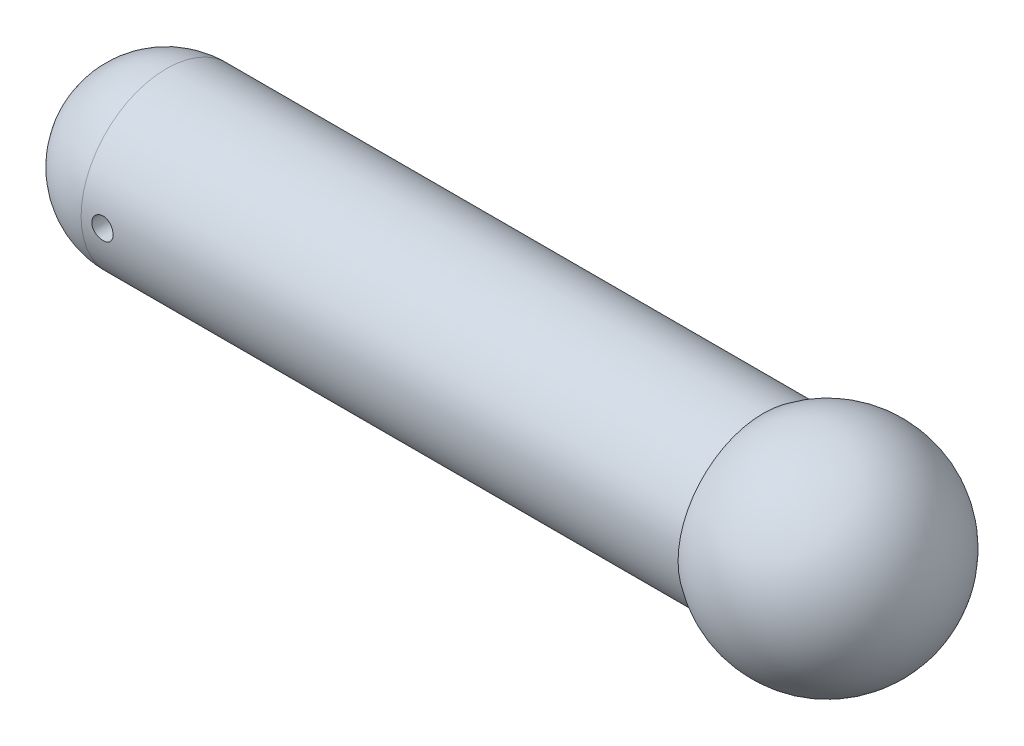
ISO-10303-21;
HEADER;
FILE_DESCRIPTION(('STEP AP214'),'2;1');
FILE_NAME('part.step','',(''),(''),'','','');
FILE_SCHEMA(('AUTOMOTIVE_DESIGN { 1 0 10303 214 1 1 1 1 }'));
ENDSEC;
DATA;
#1=APPLICATION_CONTEXT('core data for automotive mechanical design processes');
#2=APPLICATION_PROTOCOL_DEFINITION('international standard','automotive_design',2000,#1);
#3=PRODUCT_CONTEXT('',#1,'mechanical');
#4=PRODUCT('Part','Part','',(#3));
#5=PRODUCT_RELATED_PRODUCT_CATEGORY('part','',(#4));
#6=PRODUCT_DEFINITION_FORMATION('','',#4);
#7=PRODUCT_DEFINITION_CONTEXT('part definition',#1,'design');
#8=PRODUCT_DEFINITION('design','',#6,#7);
#9=PRODUCT_DEFINITION_SHAPE('','',#8);
#10=(LENGTH_UNIT() NAMED_UNIT(*) SI_UNIT(.MILLI.,.METRE.));
#11=(NAMED_UNIT(*) PLANE_ANGLE_UNIT() SI_UNIT($,.RADIAN.));
#12=(NAMED_UNIT(*) SI_UNIT($,.STERADIAN.) SOLID_ANGLE_UNIT());
#13=UNCERTAINTY_MEASURE_WITH_UNIT(LENGTH_MEASURE(1.E-05),#10,'distance_accuracy_value','');
#14=(GEOMETRIC_REPRESENTATION_CONTEXT(3) GLOBAL_UNCERTAINTY_ASSIGNED_CONTEXT((#13)) GLOBAL_UNIT_ASSIGNED_CONTEXT((#10,
#11,#12)) REPRESENTATION_CONTEXT('',''));
#15=CARTESIAN_POINT('',(0.,0.,0.));
#16=DIRECTION('',(0.,0.,1.));
#17=DIRECTION('',(1.,0.,0.));
#18=AXIS2_PLACEMENT_3D('',#15,#16,#17);
#19=CARTESIAN_POINT('',(-32.9192546583851,0.,0.));
#20=DIRECTION('',(-1.,0.,0.));
#21=DIRECTION('',(0.,0.,-1.));
#22=AXIS2_PLACEMENT_3D('',#19,#20,#21);
#23=SPHERICAL_SURFACE('',#22,20.);
#24=CARTESIAN_POINT('',(-32.9192546583851,0.,0.));
#25=DIRECTION('',(-1.,0.,0.));
#26=DIRECTION('',(0.,0.,1.));
#27=AXIS2_PLACEMENT_3D('',#24,#25,#26);
#28=CIRCLE('',#27,20.);
#29=CARTESIAN_POINT('',(-32.9192546583851,0.,20.));
#30=VERTEX_POINT('',#29);
#31=EDGE_CURVE('E42',#30,#30,#28,.T.);
#32=ORIENTED_EDGE('',*,*,#31,.T.);
#33=EDGE_LOOP('',(#32));
#34=FACE_BOUND('',#33,.T.);
#35=ADVANCED_FACE('F30',(#34),#23,.T.);
#36=CARTESIAN_POINT('',(122.080745341615,0.,0.));
#37=DIRECTION('',(-1.,0.,0.));
#38=DIRECTION('',(0.,0.,-1.));
#39=AXIS2_PLACEMENT_3D('',#36,#37,#38);
#40=SPHERICAL_SURFACE('',#39,25.);
#41=CARTESIAN_POINT('',(107.080745341615,0.,0.));
#42=DIRECTION('',(-1.,0.,0.));
#43=DIRECTION('',(0.,0.,1.));
#44=AXIS2_PLACEMENT_3D('',#41,#42,#43);
#45=CIRCLE('',#44,20.);
#46=CARTESIAN_POINT('',(107.080745341615,0.,20.));
#47=VERTEX_POINT('',#46);
#48=EDGE_CURVE('E10',#47,#47,#45,.T.);
#49=ORIENTED_EDGE('',*,*,#48,.F.);
#50=EDGE_LOOP('',(#49));
#51=FACE_BOUND('',#50,.T.);
#52=ADVANCED_FACE('F63',(#51),#40,.T.);
#53=CARTESIAN_POINT('',(-63.0852809193508,0.,0.));
#54=DIRECTION('',(-1.,0.,0.));
#55=DIRECTION('',(0.,0.,1.));
#56=AXIS2_PLACEMENT_3D('',#53,#54,#55);
#57=CYLINDRICAL_SURFACE('',#56,20.);
#58=CARTESIAN_POINT('',(-25.4192546583851,0.,20.));
#59=CARTESIAN_POINT('',(-25.4192605993208,-0.139841095555762,19.9999980489643));
#60=CARTESIAN_POINT('',(-25.4310275375544,-0.279769574302747,19.998517845549));
#61=CARTESIAN_POINT('',(-25.4777824129559,-0.555732802089753,19.9927554011136));
#62=CARTESIAN_POINT('',(-25.5127945963085,-0.691763330623745,19.9884702344143));
#63=CARTESIAN_POINT('',(-25.6049923022992,-0.955895574813053,19.9775806104441));
#64=CARTESIAN_POINT('',(-25.6621629001949,-1.08400256014614,19.9709777145554));
#65=CARTESIAN_POINT('',(-25.7970219423549,-1.32877947489303,19.956187008781));
#66=CARTESIAN_POINT('',(-25.8747068669158,-1.44545136155637,19.9479994708412));
#67=CARTESIAN_POINT('',(-26.0488466082247,-1.66471281693132,19.9309032130633));
#68=CARTESIAN_POINT('',(-26.1453917877313,-1.76723036493713,19.9219911469242));
#69=CARTESIAN_POINT('',(-26.3543174819217,-1.95465279355749,19.9044772600975));
#70=CARTESIAN_POINT('',(-26.4666988032983,-2.03955677639225,19.8958754552427));
#71=CARTESIAN_POINT('',(-26.7045746359508,-2.18961016128394,19.8799230561959));
#72=CARTESIAN_POINT('',(-26.830112019953,-2.25469209594107,19.8725767717791));
#73=CARTESIAN_POINT('',(-27.0904417103324,-2.36282307657512,19.8600112845768));
#74=CARTESIAN_POINT('',(-27.2252336655321,-2.40587295806521,19.8547920011314));
#75=CARTESIAN_POINT('',(-27.4994988539719,-2.46849898002476,19.8471033960361));
#76=CARTESIAN_POINT('',(-27.6389439160893,-2.4881967147317,19.8446198343675));
#77=CARTESIAN_POINT('',(-27.9191809218569,-2.50393554955723,19.8426402814279));
#78=CARTESIAN_POINT('',(-28.0599728111164,-2.49997760100242,19.8431441700151));
#79=CARTESIAN_POINT('',(-28.3380594856339,-2.4686172364479,19.8470695536975));
#80=CARTESIAN_POINT('',(-28.4753696445853,-2.4413487629847,19.8504743796033));
#81=CARTESIAN_POINT('',(-28.7434496796041,-2.36435038318205,19.8597919975763));
#82=CARTESIAN_POINT('',(-28.8742194230991,-2.3146200217519,19.8657048404572));
#83=CARTESIAN_POINT('',(-29.1259226574068,-2.19396555991165,19.8793911586465));
#84=CARTESIAN_POINT('',(-29.2468279586341,-2.12298325370764,19.8871697321144));
#85=CARTESIAN_POINT('',(-29.4750613527983,-1.96188146945692,19.903707114306));
#86=CARTESIAN_POINT('',(-29.5823888243588,-1.87176111608078,19.9124659678566));
#87=CARTESIAN_POINT('',(-29.7811973691078,-1.67419911075378,19.9300510989043));
#88=CARTESIAN_POINT('',(-29.8725637501511,-1.56664200784001,19.9388774238689));
#89=CARTESIAN_POINT('',(-30.0359635384156,-1.33765716911392,19.9555463255585));
#90=CARTESIAN_POINT('',(-30.1079969010571,-1.21622940131825,19.9633889000151));
#91=CARTESIAN_POINT('',(-30.230685978849,-0.962861671363481,19.9772115221858));
#92=CARTESIAN_POINT('',(-30.2813345122663,-0.830918195337716,19.9831909440154));
#93=CARTESIAN_POINT('',(-30.3597251519083,-0.560307940431055,19.9926078578006));
#94=CARTESIAN_POINT('',(-30.3874683305221,-0.421641476630666,19.9960454687587));
#95=CARTESIAN_POINT('',(-30.4191120826456,-0.142513163913496,19.9999759641076));
#96=CARTESIAN_POINT('',(-30.4231706507492,-0.00206949019860629,20.0004883614264));
#97=CARTESIAN_POINT('',(-30.4077469243291,0.277496036497496,19.9985633800543));
#98=CARTESIAN_POINT('',(-30.3882651311335,0.416617917564706,19.9961260641821));
#99=CARTESIAN_POINT('',(-30.3264449496107,0.689124507721521,19.9885876875669));
#100=CARTESIAN_POINT('',(-30.2841818949824,0.822526570424704,19.9834954081387));
#101=CARTESIAN_POINT('',(-30.1780772064722,1.08034965485841,19.971217231002));
#102=CARTESIAN_POINT('',(-30.1142348398937,1.20477037146531,19.9640312622062));
#103=CARTESIAN_POINT('',(-29.9664015208776,1.44180452068742,19.9483182291011));
#104=CARTESIAN_POINT('',(-29.8823083685794,1.55435375994382,19.9397844404251));
#105=CARTESIAN_POINT('',(-29.6965051608509,1.76379698962632,19.9223514232566));
#106=CARTESIAN_POINT('',(-29.5947944061341,1.86069035833686,19.913452180269));
#107=CARTESIAN_POINT('',(-29.3759472416279,2.03663195881801,19.8962310546258));
#108=CARTESIAN_POINT('',(-29.2587263120747,2.11557546056793,19.8879127472133));
#109=CARTESIAN_POINT('',(-29.0125964135304,2.2526528894435,19.8728541103715));
#110=CARTESIAN_POINT('',(-28.8836876789086,2.31078723372837,19.8661137493103));
#111=CARTESIAN_POINT('',(-28.6181793392375,2.40442657886654,19.85499850393));
#112=CARTESIAN_POINT('',(-28.4816008283371,2.43999062745711,19.8506174518479));
#113=CARTESIAN_POINT('',(-28.2043521746044,2.48766999386784,19.8446991590746));
#114=CARTESIAN_POINT('',(-28.0636822224261,2.49978640253576,19.8431617860878));
#115=CARTESIAN_POINT('',(-27.7832857291804,2.50020653608484,19.8431087698246));
#116=CARTESIAN_POINT('',(-27.6435594100532,2.48867479769927,19.8445722475195));
#117=CARTESIAN_POINT('',(-27.36804752904,2.44247440484933,19.850311145372));
#118=CARTESIAN_POINT('',(-27.2322619675763,2.40780574790577,19.8545865658308));
#119=CARTESIAN_POINT('',(-26.9685077016187,2.31636707368966,19.8654611577455));
#120=CARTESIAN_POINT('',(-26.8405362133633,2.25960498097093,19.8720594959278));
#121=CARTESIAN_POINT('',(-26.5959080043368,2.12560690215031,19.8868378324482));
#122=CARTESIAN_POINT('',(-26.4792514253653,2.04837065950959,19.8950178506041));
#123=CARTESIAN_POINT('',(-26.2597234330446,1.87500633126584,19.9121060475223));
#124=CARTESIAN_POINT('',(-26.1569491974301,1.77875562577496,19.9210187208403));
#125=CARTESIAN_POINT('',(-25.9689478332171,1.57035022696839,19.938528315929));
#126=CARTESIAN_POINT('',(-25.8837248476108,1.45819178914157,19.9471251627559));
#127=CARTESIAN_POINT('',(-25.7329693012798,1.22066562085421,19.9630705658675));
#128=CARTESIAN_POINT('',(-25.6675128524858,1.09524927959617,19.970414250783));
#129=CARTESIAN_POINT('',(-25.5586834154688,0.835182902301281,19.9829764907673));
#130=CARTESIAN_POINT('',(-25.5152864320316,0.700543080870237,19.9881973536958));
#131=CARTESIAN_POINT('',(-25.4621953202138,0.471005771967925,19.9946672032775));
#132=CARTESIAN_POINT('',(-25.446115716403,0.377555663516921,19.9966572589545));
#133=CARTESIAN_POINT('',(-25.4246434126919,0.189417063212435,19.9993243132919));
#134=CARTESIAN_POINT('',(-25.4192506339858,0.0947285804960274,20.0000013216347));
#135=CARTESIAN_POINT('',(-25.4192546583851,0.,20.));
#136=B_SPLINE_CURVE_WITH_KNOTS('',3,(#58,#59,#60,#61,#62,#63,#64,#65,#66,#67,#68,#69,#70,#71,
#72,#73,#74,#75,#76,#77,#78,#79,#80,#81,#82,#83,#84,#85,#86,#87,#88,#89,#90,#91,#92,#93,#94,#95,
#96,#97,#98,#99,#100,#101,#102,#103,#104,#105,#106,#107,#108,#109,#110,#111,#112,#113,#114,#115,
#116,#117,#118,#119,#120,#121,#122,#123,#124,#125,#126,#127,#128,#129,#130,#131,#132,#133,#134,
#135),.UNSPECIFIED.,.T.,.F.,(4,2,2,2,2,2,2,2,2,2,2,2,2,2,2,2,2,2,2,2,2,2,2,2,2,2,2,2,2,2,2,2,2,
2,2,2,2,2,4),(0.,0.419177272776247,0.838792460943427,1.25812550818177,1.67738665591073,
2.09870813201843,2.52005107800011,2.94281250318869,3.36555789496806,3.78609225286321,
4.20660969884663,4.62472696441691,5.0428527016624,5.46213426285533,5.88143500513638,
6.30363478136416,6.72583553113113,7.14817795731605,7.5705006090378,7.99000279391921,
8.40949604501928,8.82761053893395,9.24573923078947,9.66602402928421,10.0863255137509,
10.5090197150757,10.9317054422154,11.3532807428092,11.7748364301062,12.1934690120221,
12.6121016387955,13.0305842470649,13.4490720991226,13.8703523769183,14.2917319847001,
14.7147140303685,15.1372349868403,15.4211884318763,15.7051397830044),.UNSPECIFIED.);
#137=CARTESIAN_POINT('',(-25.4192546583851,0.,20.));
#138=VERTEX_POINT('',#137);
#139=EDGE_CURVE('E33',#138,#138,#136,.T.);
#140=ORIENTED_EDGE('',*,*,#139,.T.);
#141=EDGE_LOOP('',(#140));
#142=FACE_BOUND('',#141,.T.);
#143=CARTESIAN_POINT('',(-25.4192546583851,0.,-20.));
#144=CARTESIAN_POINT('',(-25.4192605993208,0.139841095555762,-19.9999980489643));
#145=CARTESIAN_POINT('',(-25.4310275375544,0.279769574302747,-19.998517845549));
#146=CARTESIAN_POINT('',(-25.4777824129559,0.555732802089753,-19.9927554011136));
#147=CARTESIAN_POINT('',(-25.5127945963085,0.691763330623745,-19.9884702344143));
#148=CARTESIAN_POINT('',(-25.6049923022992,0.955895574813055,-19.9775806104441));
#149=CARTESIAN_POINT('',(-25.6621629001949,1.08400256014614,-19.9709777145554));
#150=CARTESIAN_POINT('',(-25.7970219423549,1.32877947489304,-19.956187008781));
#151=CARTESIAN_POINT('',(-25.8747068669158,1.44545136155637,-19.9479994708412));
#152=CARTESIAN_POINT('',(-26.0488466082247,1.66471281693132,-19.9309032130633));
#153=CARTESIAN_POINT('',(-26.1453917877313,1.76723036493713,-19.9219911469242));
#154=CARTESIAN_POINT('',(-26.3543174819217,1.95465279355749,-19.9044772600975));
#155=CARTESIAN_POINT('',(-26.4666988032983,2.03955677639225,-19.8958754552427));
#156=CARTESIAN_POINT('',(-26.7045746359508,2.18961016128394,-19.8799230561959));
#157=CARTESIAN_POINT('',(-26.830112019953,2.25469209594107,-19.8725767717791));
#158=CARTESIAN_POINT('',(-27.0904417103324,2.36282307657512,-19.8600112845768));
#159=CARTESIAN_POINT('',(-27.2252336655321,2.40587295806521,-19.8547920011314));
#160=CARTESIAN_POINT('',(-27.4994988539719,2.46849898002476,-19.8471033960361));
#161=CARTESIAN_POINT('',(-27.6389439160893,2.4881967147317,-19.8446198343675));
#162=CARTESIAN_POINT('',(-27.9191809218569,2.50393554955723,-19.8426402814279));
#163=CARTESIAN_POINT('',(-28.0599728111164,2.49997760100242,-19.8431441700151));
#164=CARTESIAN_POINT('',(-28.3380594856339,2.4686172364479,-19.8470695536975));
#165=CARTESIAN_POINT('',(-28.4753696445853,2.4413487629847,-19.8504743796033));
#166=CARTESIAN_POINT('',(-28.7434496796041,2.36435038318205,-19.8597919975763));
#167=CARTESIAN_POINT('',(-28.8742194230991,2.3146200217519,-19.8657048404572));
#168=CARTESIAN_POINT('',(-29.1259226574068,2.19396555991165,-19.8793911586465));
#169=CARTESIAN_POINT('',(-29.2468279586341,2.12298325370764,-19.8871697321144));
#170=CARTESIAN_POINT('',(-29.4750613527983,1.96188146945692,-19.903707114306));
#171=CARTESIAN_POINT('',(-29.5823888243588,1.87176111608078,-19.9124659678566));
#172=CARTESIAN_POINT('',(-29.7811973691078,1.67419911075378,-19.9300510989043));
#173=CARTESIAN_POINT('',(-29.8725637501511,1.56664200784001,-19.9388774238689));
#174=CARTESIAN_POINT('',(-30.0359635384156,1.33765716911392,-19.9555463255585));
#175=CARTESIAN_POINT('',(-30.1079969010571,1.21622940131825,-19.9633889000151));
#176=CARTESIAN_POINT('',(-30.230685978849,0.96286167136348,-19.9772115221858));
#177=CARTESIAN_POINT('',(-30.2813345122663,0.830918195337715,-19.9831909440154));
#178=CARTESIAN_POINT('',(-30.3597251519083,0.560307940431054,-19.9926078578006));
#179=CARTESIAN_POINT('',(-30.3874683305221,0.421641476630665,-19.9960454687587));
#180=CARTESIAN_POINT('',(-30.4191120826456,0.142513163913495,-19.9999759641076));
#181=CARTESIAN_POINT('',(-30.4231706507492,0.00206949019860555,-20.0004883614264));
#182=CARTESIAN_POINT('',(-30.4077469243291,-0.277496036497497,-19.9985633800543));
#183=CARTESIAN_POINT('',(-30.3882651311335,-0.416617917564707,-19.9961260641821));
#184=CARTESIAN_POINT('',(-30.3264449496107,-0.689124507721522,-19.9885876875669));
#185=CARTESIAN_POINT('',(-30.2841818949824,-0.822526570424704,-19.9834954081387));
#186=CARTESIAN_POINT('',(-30.1780772064722,-1.08034965485841,-19.971217231002));
#187=CARTESIAN_POINT('',(-30.1142348398937,-1.20477037146531,-19.9640312622062));
#188=CARTESIAN_POINT('',(-29.9664015208776,-1.44180452068743,-19.9483182291011));
#189=CARTESIAN_POINT('',(-29.8823083685794,-1.55435375994382,-19.9397844404251));
#190=CARTESIAN_POINT('',(-29.6965051608509,-1.76379698962632,-19.9223514232566));
#191=CARTESIAN_POINT('',(-29.5947944061341,-1.86069035833686,-19.913452180269));
#192=CARTESIAN_POINT('',(-29.3759472416279,-2.03663195881802,-19.8962310546258));
#193=CARTESIAN_POINT('',(-29.2587263120747,-2.11557546056793,-19.8879127472133));
#194=CARTESIAN_POINT('',(-29.0125964135304,-2.2526528894435,-19.8728541103715));
#195=CARTESIAN_POINT('',(-28.8836876789086,-2.31078723372837,-19.8661137493103));
#196=CARTESIAN_POINT('',(-28.6181793392375,-2.40442657886654,-19.85499850393));
#197=CARTESIAN_POINT('',(-28.4816008283371,-2.43999062745711,-19.8506174518479));
#198=CARTESIAN_POINT('',(-28.2043521746044,-2.48766999386784,-19.8446991590746));
#199=CARTESIAN_POINT('',(-28.0636822224261,-2.49978640253576,-19.8431617860878));
#200=CARTESIAN_POINT('',(-27.7832857291804,-2.50020653608484,-19.8431087698246));
#201=CARTESIAN_POINT('',(-27.6435594100532,-2.48867479769927,-19.8445722475195));
#202=CARTESIAN_POINT('',(-27.36804752904,-2.44247440484933,-19.850311145372));
#203=CARTESIAN_POINT('',(-27.2322619675763,-2.40780574790577,-19.8545865658308));
#204=CARTESIAN_POINT('',(-26.9685077016187,-2.31636707368966,-19.8654611577455));
#205=CARTESIAN_POINT('',(-26.8405362133633,-2.25960498097093,-19.8720594959278));
#206=CARTESIAN_POINT('',(-26.5959080043368,-2.12560690215031,-19.8868378324482));
#207=CARTESIAN_POINT('',(-26.4792514253653,-2.04837065950959,-19.8950178506041));
#208=CARTESIAN_POINT('',(-26.2597234330446,-1.87500633126584,-19.9121060475223));
#209=CARTESIAN_POINT('',(-26.1569491974301,-1.77875562577496,-19.9210187208403));
#210=CARTESIAN_POINT('',(-25.9689478332171,-1.57035022696838,-19.938528315929));
#211=CARTESIAN_POINT('',(-25.8837248476108,-1.45819178914157,-19.9471251627559));
#212=CARTESIAN_POINT('',(-25.7329693012798,-1.22066562085421,-19.9630705658675));
#213=CARTESIAN_POINT('',(-25.6675128524858,-1.09524927959617,-19.970414250783));
#214=CARTESIAN_POINT('',(-25.5586834154688,-0.83518290230128,-19.9829764907673));
#215=CARTESIAN_POINT('',(-25.5152864320316,-0.700543080870235,-19.9881973536958));
#216=CARTESIAN_POINT('',(-25.4621953202138,-0.471005771967924,-19.9946672032775));
#217=CARTESIAN_POINT('',(-25.446115716403,-0.37755566351692,-19.9966572589545));
#218=CARTESIAN_POINT('',(-25.4246434126919,-0.189417063212434,-19.9993243132919));
#219=CARTESIAN_POINT('',(-25.4192506339858,-0.0947285804960272,-20.0000013216347));
#220=CARTESIAN_POINT('',(-25.4192546583851,0.,-20.));
#221=B_SPLINE_CURVE_WITH_KNOTS('',3,(#143,#144,#145,#146,#147,#148,#149,#150,#151,#152,#153,
#154,#155,#156,#157,#158,#159,#160,#161,#162,#163,#164,#165,#166,#167,#168,#169,#170,#171,#172,
#173,#174,#175,#176,#177,#178,#179,#180,#181,#182,#183,#184,#185,#186,#187,#188,#189,#190,#191,
#192,#193,#194,#195,#196,#197,#198,#199,#200,#201,#202,#203,#204,#205,#206,#207,#208,#209,#210,
#211,#212,#213,#214,#215,#216,#217,#218,#219,#220),.UNSPECIFIED.,.T.,.F.,(4,2,2,2,2,2,2,2,2,2,2,
2,2,2,2,2,2,2,2,2,2,2,2,2,2,2,2,2,2,2,2,2,2,2,2,2,2,2,4),(0.,0.419177272776247,
0.838792460943427,1.25812550818177,1.67738665591073,2.09870813201843,2.52005107800011,
2.9428125031887,3.36555789496807,3.7860922528632,4.20660969884663,4.62472696441691,
5.04285270166241,5.46213426285533,5.88143500513639,6.30363478136416,6.72583553113113,
7.14817795731605,7.5705006090378,7.99000279391921,8.40949604501928,8.82761053893395,
9.24573923078947,9.66602402928422,10.0863255137509,10.5090197150757,10.9317054422154,
11.3532807428092,11.7748364301062,12.1934690120221,12.6121016387955,13.0305842470649,
13.4490720991226,13.8703523769183,14.2917319847001,14.7147140303685,15.1372349868403,
15.4211884318763,15.7051397830044),.UNSPECIFIED.);
#222=CARTESIAN_POINT('',(-25.4192546583851,0.,-20.));
#223=VERTEX_POINT('',#222);
#224=EDGE_CURVE('E48',#223,#223,#221,.T.);
#225=ORIENTED_EDGE('',*,*,#224,.T.);
#226=EDGE_LOOP('',(#225));
#227=FACE_BOUND('',#226,.T.);
#228=ORIENTED_EDGE('',*,*,#31,.F.);
#229=EDGE_LOOP('',(#228));
#230=FACE_BOUND('',#229,.T.);
#231=ORIENTED_EDGE('',*,*,#48,.T.);
#232=EDGE_LOOP('',(#231));
#233=FACE_BOUND('',#232,.T.);
#234=ADVANCED_FACE('F53',(#142,#227,#230,#233),#57,.T.);
#235=CARTESIAN_POINT('',(-27.9192546583851,0.,-25.));
#236=DIRECTION('',(0.,0.,1.));
#237=DIRECTION('',(1.,0.,0.));
#238=AXIS2_PLACEMENT_3D('',#235,#236,#237);
#239=CYLINDRICAL_SURFACE('',#238,2.5);
#240=ORIENTED_EDGE('',*,*,#224,.F.);
#241=EDGE_LOOP('',(#240));
#242=FACE_BOUND('',#241,.T.);
#243=ORIENTED_EDGE('',*,*,#139,.F.);
#244=EDGE_LOOP('',(#243));
#245=FACE_BOUND('',#244,.T.);
#246=ADVANCED_FACE('F55',(#242,#245),#239,.F.);
#247=CLOSED_SHELL('',(#35,#52,#234,#246));
#248=MANIFOLD_SOLID_BREP('B2',#247);
#249=ADVANCED_BREP_SHAPE_REPRESENTATION('',(#18,#248),#14);
#250=SHAPE_DEFINITION_REPRESENTATION(#9,#249);
ENDSEC;
END-ISO-10303-21;
